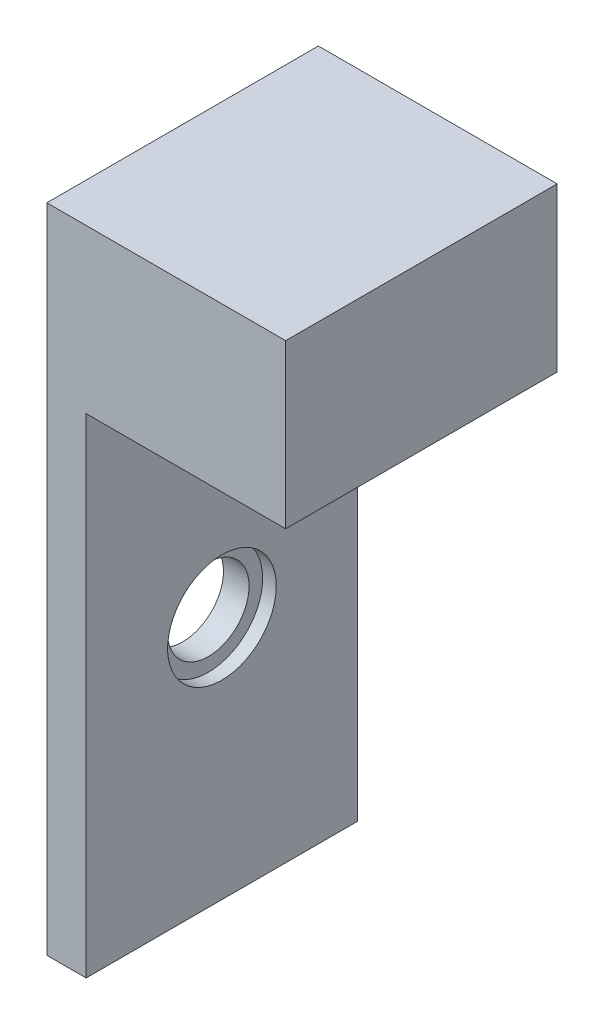
ISO-10303-21;
HEADER;
FILE_DESCRIPTION(('STEP AP214'),'2;1');
FILE_NAME('part.step','',(''),(''),'','','');
FILE_SCHEMA(('AUTOMOTIVE_DESIGN { 1 0 10303 214 1 1 1 1 }'));
ENDSEC;
DATA;
#1=APPLICATION_CONTEXT('core data for automotive mechanical design processes');
#2=APPLICATION_PROTOCOL_DEFINITION('international standard','automotive_design',2000,#1);
#3=PRODUCT_CONTEXT('',#1,'mechanical');
#4=PRODUCT('Part','Part','',(#3));
#5=PRODUCT_RELATED_PRODUCT_CATEGORY('part','',(#4));
#6=PRODUCT_DEFINITION_FORMATION('','',#4);
#7=PRODUCT_DEFINITION_CONTEXT('part definition',#1,'design');
#8=PRODUCT_DEFINITION('design','',#6,#7);
#9=PRODUCT_DEFINITION_SHAPE('','',#8);
#10=(LENGTH_UNIT() NAMED_UNIT(*) SI_UNIT(.MILLI.,.METRE.));
#11=(NAMED_UNIT(*) PLANE_ANGLE_UNIT() SI_UNIT($,.RADIAN.));
#12=(NAMED_UNIT(*) SI_UNIT($,.STERADIAN.) SOLID_ANGLE_UNIT());
#13=UNCERTAINTY_MEASURE_WITH_UNIT(LENGTH_MEASURE(1.E-05),#10,'distance_accuracy_value','');
#14=(GEOMETRIC_REPRESENTATION_CONTEXT(3) GLOBAL_UNCERTAINTY_ASSIGNED_CONTEXT((#13)) GLOBAL_UNIT_ASSIGNED_CONTEXT((#10,
#11,#12)) REPRESENTATION_CONTEXT('',''));
#15=CARTESIAN_POINT('',(0.,0.,0.));
#16=DIRECTION('',(0.,0.,1.));
#17=DIRECTION('',(1.,0.,0.));
#18=AXIS2_PLACEMENT_3D('',#15,#16,#17);
#19=CARTESIAN_POINT('',(-11.7017598994343,-20.9767441860465,10.));
#20=DIRECTION('',(0.,1.,0.));
#21=DIRECTION('',(0.,0.,1.));
#22=AXIS2_PLACEMENT_3D('',#19,#20,#21);
#23=PLANE('',#22);
#24=DIRECTION('',(1.,0.,0.));
#25=VECTOR('',#24,1.);
#26=CARTESIAN_POINT('',(-11.7017598994343,-20.9767441860465,10.));
#27=LINE('',#26,#25);
#28=CARTESIAN_POINT('',(9.5036405576415,-20.9767441860465,10.));
#29=VERTEX_POINT('',#28);
#30=CARTESIAN_POINT('',(10.9518423930361,-20.9767441860465,10.));
#31=VERTEX_POINT('',#30);
#32=EDGE_CURVE('E122',#29,#31,#27,.T.);
#33=ORIENTED_EDGE('',*,*,#32,.F.);
#34=DIRECTION('',(0.,0.,1.));
#35=VECTOR('',#34,1.);
#36=CARTESIAN_POINT('',(9.5036405576415,-20.9767441860465,0.));
#37=LINE('',#36,#35);
#38=CARTESIAN_POINT('',(9.5036405576415,-20.9767441860465,0.));
#39=VERTEX_POINT('',#38);
#40=EDGE_CURVE('E112',#39,#29,#37,.T.);
#41=ORIENTED_EDGE('',*,*,#40,.F.);
#42=DIRECTION('',(1.,0.,0.));
#43=VECTOR('',#42,1.);
#44=CARTESIAN_POINT('',(-11.7017598994343,-20.9767441860465,0.));
#45=LINE('',#44,#43);
#46=CARTESIAN_POINT('',(10.9518423930361,-20.9767441860465,0.));
#47=VERTEX_POINT('',#46);
#48=EDGE_CURVE('E120',#39,#47,#45,.T.);
#49=ORIENTED_EDGE('',*,*,#48,.T.);
#50=DIRECTION('',(0.,0.,1.));
#51=VECTOR('',#50,1.);
#52=CARTESIAN_POINT('',(10.9518423930361,-20.9767441860465,0.));
#53=LINE('',#52,#51);
#54=EDGE_CURVE('E174',#47,#31,#53,.T.);
#55=ORIENTED_EDGE('',*,*,#54,.T.);
#56=EDGE_LOOP('',(#33,#41,#49,#55));
#57=FACE_BOUND('',#56,.T.);
#58=ADVANCED_FACE('F35',(#57),#23,.F.);
#59=CARTESIAN_POINT('',(18.2982401005657,3.02325581395349,10.));
#60=DIRECTION('',(-1.,0.,0.));
#61=DIRECTION('',(0.,-1.,0.));
#62=AXIS2_PLACEMENT_3D('',#59,#60,#61);
#63=PLANE('',#62);
#64=DIRECTION('',(0.,1.,0.));
#65=VECTOR('',#64,1.);
#66=CARTESIAN_POINT('',(18.2982401005657,3.02325581395349,10.));
#67=LINE('',#66,#65);
#68=CARTESIAN_POINT('',(18.2982401005657,-2.97674418604651,10.));
#69=VERTEX_POINT('',#68);
#70=CARTESIAN_POINT('',(18.2982401005657,3.02325581395349,10.));
#71=VERTEX_POINT('',#70);
#72=EDGE_CURVE('E148',#69,#71,#67,.T.);
#73=ORIENTED_EDGE('',*,*,#72,.F.);
#74=DIRECTION('',(0.,0.,1.));
#75=VECTOR('',#74,1.);
#76=CARTESIAN_POINT('',(18.2982401005657,-2.97674418604651,0.));
#77=LINE('',#76,#75);
#78=CARTESIAN_POINT('',(18.2982401005657,-2.97674418604651,0.));
#79=VERTEX_POINT('',#78);
#80=EDGE_CURVE('E176',#79,#69,#77,.T.);
#81=ORIENTED_EDGE('',*,*,#80,.F.);
#82=DIRECTION('',(0.,1.,0.));
#83=VECTOR('',#82,1.);
#84=CARTESIAN_POINT('',(18.2982401005657,3.02325581395349,0.));
#85=LINE('',#84,#83);
#86=CARTESIAN_POINT('',(18.2982401005657,3.02325581395349,0.));
#87=VERTEX_POINT('',#86);
#88=EDGE_CURVE('E129',#79,#87,#85,.T.);
#89=ORIENTED_EDGE('',*,*,#88,.T.);
#90=DIRECTION('',(0.,0.,-1.));
#91=VECTOR('',#90,1.);
#92=CARTESIAN_POINT('',(18.2982401005657,3.02325581395349,10.));
#93=LINE('',#92,#91);
#94=EDGE_CURVE('E43',#71,#87,#93,.T.);
#95=ORIENTED_EDGE('',*,*,#94,.F.);
#96=EDGE_LOOP('',(#73,#81,#89,#95));
#97=FACE_BOUND('',#96,.T.);
#98=ADVANCED_FACE('F221',(#97),#63,.F.);
#99=CARTESIAN_POINT('',(-11.7017598994343,3.02325581395349,10.));
#100=DIRECTION('',(0.,-1.,0.));
#101=DIRECTION('',(0.,0.,-1.));
#102=AXIS2_PLACEMENT_3D('',#99,#100,#101);
#103=PLANE('',#102);
#104=DIRECTION('',(-1.,0.,0.));
#105=VECTOR('',#104,1.);
#106=CARTESIAN_POINT('',(-11.7017598994343,3.02325581395349,0.));
#107=LINE('',#106,#105);
#108=CARTESIAN_POINT('',(9.5036405576415,3.02325581395349,0.));
#109=VERTEX_POINT('',#108);
#110=EDGE_CURVE('E132',#87,#109,#107,.T.);
#111=ORIENTED_EDGE('',*,*,#110,.T.);
#112=DIRECTION('',(0.,0.,1.));
#113=VECTOR('',#112,1.);
#114=CARTESIAN_POINT('',(9.5036405576415,3.02325581395349,0.));
#115=LINE('',#114,#113);
#116=CARTESIAN_POINT('',(9.5036405576415,3.02325581395349,10.));
#117=VERTEX_POINT('',#116);
#118=EDGE_CURVE('E123',#109,#117,#115,.T.);
#119=ORIENTED_EDGE('',*,*,#118,.T.);
#120=DIRECTION('',(-1.,0.,0.));
#121=VECTOR('',#120,1.);
#122=CARTESIAN_POINT('',(-11.7017598994343,3.02325581395349,10.));
#123=LINE('',#122,#121);
#124=EDGE_CURVE('E137',#71,#117,#123,.T.);
#125=ORIENTED_EDGE('',*,*,#124,.F.);
#126=ORIENTED_EDGE('',*,*,#94,.T.);
#127=EDGE_LOOP('',(#111,#119,#125,#126));
#128=FACE_BOUND('',#127,.T.);
#129=ADVANCED_FACE('F225',(#128),#103,.F.);
#130=CARTESIAN_POINT('',(0.,0.,10.));
#131=DIRECTION('',(0.,0.,1.));
#132=DIRECTION('',(1.,0.,0.));
#133=AXIS2_PLACEMENT_3D('',#130,#131,#132);
#134=PLANE('',#133);
#135=DIRECTION('',(0.,1.,0.));
#136=VECTOR('',#135,1.);
#137=CARTESIAN_POINT('',(9.5036405576415,3.02325581395349,10.));
#138=LINE('',#137,#136);
#139=CARTESIAN_POINT('',(9.5036405576415,-18.9767441860465,10.));
#140=VERTEX_POINT('',#139);
#141=EDGE_CURVE('E58',#29,#140,#138,.T.);
#142=ORIENTED_EDGE('',*,*,#141,.F.);
#143=ORIENTED_EDGE('',*,*,#32,.T.);
#144=DIRECTION('',(0.,-1.,0.));
#145=VECTOR('',#144,1.);
#146=CARTESIAN_POINT('',(10.9518423930361,-20.9767441860465,10.));
#147=LINE('',#146,#145);
#148=CARTESIAN_POINT('',(10.9518423930361,-2.97674418604651,10.));
#149=VERTEX_POINT('',#148);
#150=EDGE_CURVE('E183',#149,#31,#147,.T.);
#151=ORIENTED_EDGE('',*,*,#150,.F.);
#152=DIRECTION('',(-1.,0.,0.));
#153=VECTOR('',#152,1.);
#154=CARTESIAN_POINT('',(10.9518423930361,-2.97674418604651,10.));
#155=LINE('',#154,#153);
#156=EDGE_CURVE('E180',#69,#149,#155,.T.);
#157=ORIENTED_EDGE('',*,*,#156,.F.);
#158=ORIENTED_EDGE('',*,*,#72,.T.);
#159=ORIENTED_EDGE('',*,*,#124,.T.);
#160=CARTESIAN_POINT('',(9.5036405576415,1.02325581395349,10.));
#161=VERTEX_POINT('',#160);
#162=EDGE_CURVE('E192',#161,#117,#138,.T.);
#163=ORIENTED_EDGE('',*,*,#162,.F.);
#164=DIRECTION('',(-1.,0.,0.));
#165=VECTOR('',#164,1.);
#166=CARTESIAN_POINT('',(-10.490787107899,1.02325581395349,10.));
#167=LINE('',#166,#165);
#168=CARTESIAN_POINT('',(9.50921289210097,1.02325581395349,10.));
#169=VERTEX_POINT('',#168);
#170=EDGE_CURVE('E158',#169,#161,#167,.T.);
#171=ORIENTED_EDGE('',*,*,#170,.F.);
#172=DIRECTION('',(0.,1.,0.));
#173=VECTOR('',#172,1.);
#174=CARTESIAN_POINT('',(9.50921289210097,1.02325581395349,10.));
#175=LINE('',#174,#173);
#176=CARTESIAN_POINT('',(9.50921289210097,-18.9767441860465,10.));
#177=VERTEX_POINT('',#176);
#178=EDGE_CURVE('E162',#177,#169,#175,.T.);
#179=ORIENTED_EDGE('',*,*,#178,.F.);
#180=DIRECTION('',(1.,0.,0.));
#181=VECTOR('',#180,1.);
#182=CARTESIAN_POINT('',(-10.490787107899,-18.9767441860465,10.));
#183=LINE('',#182,#181);
#184=EDGE_CURVE('E165',#140,#177,#183,.T.);
#185=ORIENTED_EDGE('',*,*,#184,.F.);
#186=EDGE_LOOP('',(#142,#143,#151,#157,#158,#159,#163,#171,#179,#185));
#187=FACE_BOUND('',#186,.T.);
#188=ADVANCED_FACE('F230',(#187),#134,.T.);
#189=CARTESIAN_POINT('',(0.,0.,0.));
#190=DIRECTION('',(0.,0.,1.));
#191=DIRECTION('',(1.,0.,0.));
#192=AXIS2_PLACEMENT_3D('',#189,#190,#191);
#193=PLANE('',#192);
#194=ORIENTED_EDGE('',*,*,#48,.F.);
#195=DIRECTION('',(0.,1.,0.));
#196=VECTOR('',#195,1.);
#197=CARTESIAN_POINT('',(9.5036405576415,3.02325581395349,0.));
#198=LINE('',#197,#196);
#199=CARTESIAN_POINT('',(9.5036405576415,-18.9767441860465,0.));
#200=VERTEX_POINT('',#199);
#201=EDGE_CURVE('E109',#39,#200,#198,.T.);
#202=ORIENTED_EDGE('',*,*,#201,.T.);
#203=DIRECTION('',(1.,0.,0.));
#204=VECTOR('',#203,1.);
#205=CARTESIAN_POINT('',(-10.490787107899,-18.9767441860465,0.));
#206=LINE('',#205,#204);
#207=CARTESIAN_POINT('',(9.50921289210097,-18.9767441860465,0.));
#208=VERTEX_POINT('',#207);
#209=EDGE_CURVE('E161',#200,#208,#206,.T.);
#210=ORIENTED_EDGE('',*,*,#209,.T.);
#211=DIRECTION('',(0.,1.,0.));
#212=VECTOR('',#211,1.);
#213=CARTESIAN_POINT('',(9.50921289210097,1.02325581395349,0.));
#214=LINE('',#213,#212);
#215=CARTESIAN_POINT('',(9.50921289210097,1.02325581395349,0.));
#216=VERTEX_POINT('',#215);
#217=EDGE_CURVE('E170',#208,#216,#214,.T.);
#218=ORIENTED_EDGE('',*,*,#217,.T.);
#219=DIRECTION('',(-1.,0.,0.));
#220=VECTOR('',#219,1.);
#221=CARTESIAN_POINT('',(-10.490787107899,1.02325581395349,0.));
#222=LINE('',#221,#220);
#223=CARTESIAN_POINT('',(9.50364055764149,1.02325581395349,0.));
#224=VERTEX_POINT('',#223);
#225=EDGE_CURVE('E156',#216,#224,#222,.T.);
#226=ORIENTED_EDGE('',*,*,#225,.T.);
#227=EDGE_CURVE('E50',#224,#109,#198,.T.);
#228=ORIENTED_EDGE('',*,*,#227,.T.);
#229=ORIENTED_EDGE('',*,*,#110,.F.);
#230=ORIENTED_EDGE('',*,*,#88,.F.);
#231=DIRECTION('',(-1.,0.,0.));
#232=VECTOR('',#231,1.);
#233=CARTESIAN_POINT('',(10.9518423930361,-2.97674418604651,0.));
#234=LINE('',#233,#232);
#235=CARTESIAN_POINT('',(10.9518423930361,-2.97674418604651,0.));
#236=VERTEX_POINT('',#235);
#237=EDGE_CURVE('E177',#79,#236,#234,.T.);
#238=ORIENTED_EDGE('',*,*,#237,.T.);
#239=DIRECTION('',(0.,-1.,0.));
#240=VECTOR('',#239,1.);
#241=CARTESIAN_POINT('',(10.9518423930361,-20.9767441860465,0.));
#242=LINE('',#241,#240);
#243=EDGE_CURVE('E128',#236,#47,#242,.T.);
#244=ORIENTED_EDGE('',*,*,#243,.T.);
#245=EDGE_LOOP('',(#194,#202,#210,#218,#226,#228,#229,#230,#238,#244));
#246=FACE_BOUND('',#245,.T.);
#247=ADVANCED_FACE('F126',(#246),#193,.F.);
#248=CARTESIAN_POINT('',(-10.490787107899,1.02325581395349,0.));
#249=DIRECTION('',(0.,1.,0.));
#250=DIRECTION('',(0.,0.,1.));
#251=AXIS2_PLACEMENT_3D('',#248,#249,#250);
#252=PLANE('',#251);
#253=ORIENTED_EDGE('',*,*,#170,.T.);
#254=DIRECTION('',(0.,0.,-1.));
#255=VECTOR('',#254,1.);
#256=CARTESIAN_POINT('',(9.5036405576415,1.02325581395349,0.));
#257=LINE('',#256,#255);
#258=EDGE_CURVE('E186',#161,#224,#257,.T.);
#259=ORIENTED_EDGE('',*,*,#258,.T.);
#260=ORIENTED_EDGE('',*,*,#225,.F.);
#261=DIRECTION('',(0.,0.,1.));
#262=VECTOR('',#261,1.);
#263=CARTESIAN_POINT('',(9.50921289210097,1.02325581395349,0.));
#264=LINE('',#263,#262);
#265=EDGE_CURVE('E130',#216,#169,#264,.T.);
#266=ORIENTED_EDGE('',*,*,#265,.T.);
#267=EDGE_LOOP('',(#253,#259,#260,#266));
#268=FACE_BOUND('',#267,.T.);
#269=ADVANCED_FACE('F235',(#268),#252,.F.);
#270=CARTESIAN_POINT('',(9.50921289210097,1.02325581395349,0.));
#271=DIRECTION('',(1.,0.,0.));
#272=DIRECTION('',(0.,1.,0.));
#273=AXIS2_PLACEMENT_3D('',#270,#271,#272);
#274=PLANE('',#273);
#275=CARTESIAN_POINT('',(9.50921289210097,-11.9767441860465,5.));
#276=DIRECTION('',(1.,0.,0.));
#277=DIRECTION('',(0.,1.,0.));
#278=AXIS2_PLACEMENT_3D('',#275,#276,#277);
#279=CIRCLE('',#278,1.5);
#280=CARTESIAN_POINT('',(9.50921289210097,-10.4767441860465,5.));
#281=VERTEX_POINT('',#280);
#282=EDGE_CURVE('E38',#281,#281,#279,.T.);
#283=ORIENTED_EDGE('',*,*,#282,.T.);
#284=EDGE_LOOP('',(#283));
#285=FACE_BOUND('',#284,.T.);
#286=ORIENTED_EDGE('',*,*,#178,.T.);
#287=ORIENTED_EDGE('',*,*,#265,.F.);
#288=ORIENTED_EDGE('',*,*,#217,.F.);
#289=DIRECTION('',(0.,0.,1.));
#290=VECTOR('',#289,1.);
#291=CARTESIAN_POINT('',(9.50921289210097,-18.9767441860465,0.));
#292=LINE('',#291,#290);
#293=EDGE_CURVE('E134',#208,#177,#292,.T.);
#294=ORIENTED_EDGE('',*,*,#293,.T.);
#295=EDGE_LOOP('',(#286,#287,#288,#294));
#296=FACE_BOUND('',#295,.T.);
#297=ADVANCED_FACE('F207',(#285,#296),#274,.F.);
#298=CARTESIAN_POINT('',(-10.490787107899,-18.9767441860465,0.));
#299=DIRECTION('',(0.,-1.,0.));
#300=DIRECTION('',(0.,0.,-1.));
#301=AXIS2_PLACEMENT_3D('',#298,#299,#300);
#302=PLANE('',#301);
#303=ORIENTED_EDGE('',*,*,#209,.F.);
#304=DIRECTION('',(0.,0.,1.));
#305=VECTOR('',#304,1.);
#306=CARTESIAN_POINT('',(9.5036405576415,-18.9767441860465,0.));
#307=LINE('',#306,#305);
#308=EDGE_CURVE('E11',#200,#140,#307,.T.);
#309=ORIENTED_EDGE('',*,*,#308,.T.);
#310=ORIENTED_EDGE('',*,*,#184,.T.);
#311=ORIENTED_EDGE('',*,*,#293,.F.);
#312=EDGE_LOOP('',(#303,#309,#310,#311));
#313=FACE_BOUND('',#312,.T.);
#314=ADVANCED_FACE('F238',(#313),#302,.F.);
#315=CARTESIAN_POINT('',(10.9518423930361,-20.9767441860465,0.));
#316=DIRECTION('',(-1.,0.,0.));
#317=DIRECTION('',(0.,0.,1.));
#318=AXIS2_PLACEMENT_3D('',#315,#316,#317);
#319=PLANE('',#318);
#320=CARTESIAN_POINT('',(10.9518423930361,-11.9767441860465,5.));
#321=DIRECTION('',(1.,0.,0.));
#322=DIRECTION('',(0.,0.,-1.));
#323=AXIS2_PLACEMENT_3D('',#320,#321,#322);
#324=CIRCLE('',#323,2.);
#325=CARTESIAN_POINT('',(10.9518423930361,-11.9767441860465,3.));
#326=VERTEX_POINT('',#325);
#327=EDGE_CURVE('E194',#326,#326,#324,.T.);
#328=ORIENTED_EDGE('',*,*,#327,.F.);
#329=EDGE_LOOP('',(#328));
#330=FACE_BOUND('',#329,.T.);
#331=ORIENTED_EDGE('',*,*,#150,.T.);
#332=ORIENTED_EDGE('',*,*,#54,.F.);
#333=ORIENTED_EDGE('',*,*,#243,.F.);
#334=DIRECTION('',(0.,0.,1.));
#335=VECTOR('',#334,1.);
#336=CARTESIAN_POINT('',(10.9518423930361,-2.97674418604651,0.));
#337=LINE('',#336,#335);
#338=EDGE_CURVE('E167',#236,#149,#337,.T.);
#339=ORIENTED_EDGE('',*,*,#338,.T.);
#340=EDGE_LOOP('',(#331,#332,#333,#339));
#341=FACE_BOUND('',#340,.T.);
#342=ADVANCED_FACE('F241',(#330,#341),#319,.F.);
#343=CARTESIAN_POINT('',(10.9518423930361,-2.97674418604651,0.));
#344=DIRECTION('',(0.,1.,0.));
#345=DIRECTION('',(0.,0.,1.));
#346=AXIS2_PLACEMENT_3D('',#343,#344,#345);
#347=PLANE('',#346);
#348=ORIENTED_EDGE('',*,*,#156,.T.);
#349=ORIENTED_EDGE('',*,*,#338,.F.);
#350=ORIENTED_EDGE('',*,*,#237,.F.);
#351=ORIENTED_EDGE('',*,*,#80,.T.);
#352=EDGE_LOOP('',(#348,#349,#350,#351));
#353=FACE_BOUND('',#352,.T.);
#354=ADVANCED_FACE('F250',(#353),#347,.F.);
#355=CARTESIAN_POINT('',(9.5036405576415,3.02325581395349,0.));
#356=DIRECTION('',(1.,0.,0.));
#357=DIRECTION('',(0.,0.,-1.));
#358=AXIS2_PLACEMENT_3D('',#355,#356,#357);
#359=PLANE('',#358);
#360=ORIENTED_EDGE('',*,*,#201,.F.);
#361=ORIENTED_EDGE('',*,*,#40,.T.);
#362=ORIENTED_EDGE('',*,*,#141,.T.);
#363=ORIENTED_EDGE('',*,*,#308,.F.);
#364=EDGE_LOOP('',(#360,#361,#362,#363));
#365=FACE_BOUND('',#364,.T.);
#366=ADVANCED_FACE('F111',(#365),#359,.F.);
#367=ORIENTED_EDGE('',*,*,#162,.T.);
#368=ORIENTED_EDGE('',*,*,#118,.F.);
#369=ORIENTED_EDGE('',*,*,#227,.F.);
#370=ORIENTED_EDGE('',*,*,#258,.F.);
#371=EDGE_LOOP('',(#367,#368,#369,#370));
#372=FACE_BOUND('',#371,.T.);
#373=ADVANCED_FACE('F255',(#372),#359,.F.);
#374=CARTESIAN_POINT('',(10.4518423930361,-11.9767441860465,5.));
#375=DIRECTION('',(1.,0.,0.));
#376=DIRECTION('',(0.,0.,-1.));
#377=AXIS2_PLACEMENT_3D('',#374,#375,#376);
#378=CYLINDRICAL_SURFACE('',#377,2.);
#379=CARTESIAN_POINT('',(10.4518423930361,-11.9767441860465,5.));
#380=DIRECTION('',(1.,0.,0.));
#381=DIRECTION('',(0.,0.,-1.));
#382=AXIS2_PLACEMENT_3D('',#379,#380,#381);
#383=CIRCLE('',#382,2.);
#384=CARTESIAN_POINT('',(10.4518423930361,-11.9767441860465,3.));
#385=VERTEX_POINT('',#384);
#386=EDGE_CURVE('E197',#385,#385,#383,.T.);
#387=ORIENTED_EDGE('',*,*,#386,.F.);
#388=EDGE_LOOP('',(#387));
#389=FACE_BOUND('',#388,.T.);
#390=ORIENTED_EDGE('',*,*,#327,.T.);
#391=EDGE_LOOP('',(#390));
#392=FACE_BOUND('',#391,.T.);
#393=ADVANCED_FACE('F217',(#389,#392),#378,.F.);
#394=CARTESIAN_POINT('',(10.4518423930361,-11.9767441860465,5.));
#395=DIRECTION('',(1.,0.,0.));
#396=DIRECTION('',(0.,0.,-1.));
#397=AXIS2_PLACEMENT_3D('',#394,#395,#396);
#398=PLANE('',#397);
#399=CARTESIAN_POINT('',(10.4518423930361,-11.9767441860465,5.));
#400=DIRECTION('',(1.,0.,0.));
#401=DIRECTION('',(0.,0.,-1.));
#402=AXIS2_PLACEMENT_3D('',#399,#400,#401);
#403=CIRCLE('',#402,1.5);
#404=CARTESIAN_POINT('',(10.4518423930361,-11.9767441860465,3.5));
#405=VERTEX_POINT('',#404);
#406=EDGE_CURVE('E200',#405,#405,#403,.T.);
#407=ORIENTED_EDGE('',*,*,#406,.F.);
#408=EDGE_LOOP('',(#407));
#409=FACE_BOUND('',#408,.T.);
#410=ORIENTED_EDGE('',*,*,#386,.T.);
#411=EDGE_LOOP('',(#410));
#412=FACE_BOUND('',#411,.T.);
#413=ADVANCED_FACE('F212',(#409,#412),#398,.T.);
#414=CARTESIAN_POINT('',(-0.0481576069639115,-11.9767441860465,5.));
#415=DIRECTION('',(1.,0.,0.));
#416=DIRECTION('',(0.,0.,-1.));
#417=AXIS2_PLACEMENT_3D('',#414,#415,#416);
#418=CYLINDRICAL_SURFACE('',#417,1.5);
#419=ORIENTED_EDGE('',*,*,#406,.T.);
#420=EDGE_LOOP('',(#419));
#421=FACE_BOUND('',#420,.T.);
#422=ORIENTED_EDGE('',*,*,#282,.F.);
#423=EDGE_LOOP('',(#422));
#424=FACE_BOUND('',#423,.T.);
#425=ADVANCED_FACE('F210',(#421,#424),#418,.F.);
#426=CLOSED_SHELL('',(#58,#98,#129,#188,#247,#269,#297,#314,#342,#354,#366,#373,#393,#413,#425));
#427=MANIFOLD_SOLID_BREP('B2',#426);
#428=ADVANCED_BREP_SHAPE_REPRESENTATION('',(#18,#427),#14);
#429=SHAPE_DEFINITION_REPRESENTATION(#9,#428);
ENDSEC;
END-ISO-10303-21;
